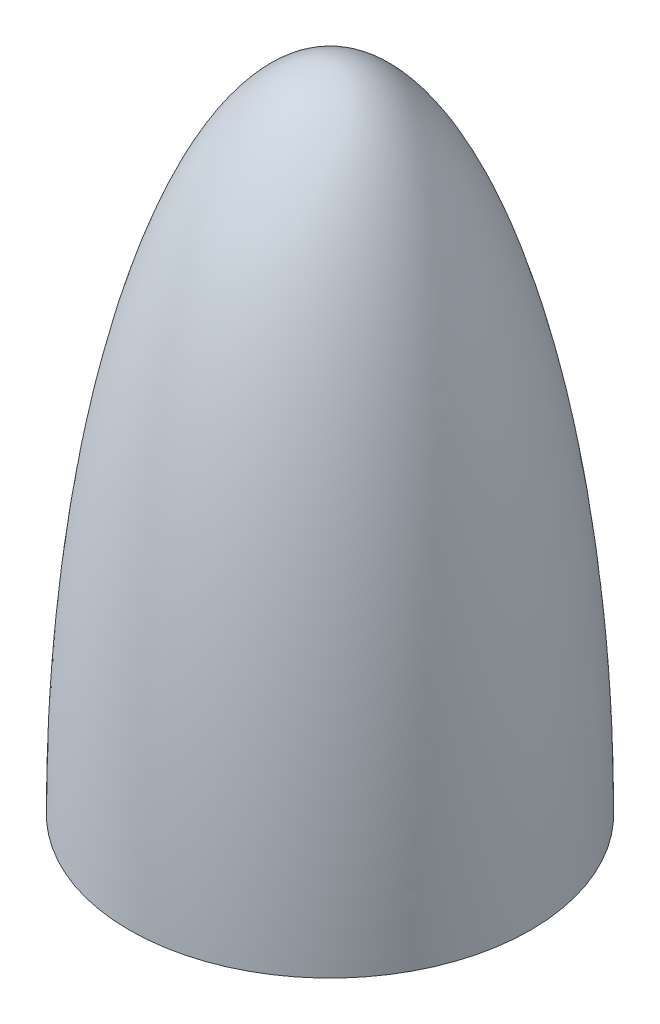
ISO-10303-21;
HEADER;
FILE_DESCRIPTION(('STEP AP214'),'2;1');
FILE_NAME('part.step','',(''),(''),'','','');
FILE_SCHEMA(('AUTOMOTIVE_DESIGN { 1 0 10303 214 1 1 1 1 }'));
ENDSEC;
DATA;
#1=APPLICATION_CONTEXT('core data for automotive mechanical design processes');
#2=APPLICATION_PROTOCOL_DEFINITION('international standard','automotive_design',2000,#1);
#3=PRODUCT_CONTEXT('',#1,'mechanical');
#4=PRODUCT('Part','Part','',(#3));
#5=PRODUCT_RELATED_PRODUCT_CATEGORY('part','',(#4));
#6=PRODUCT_DEFINITION_FORMATION('','',#4);
#7=PRODUCT_DEFINITION_CONTEXT('part definition',#1,'design');
#8=PRODUCT_DEFINITION('design','',#6,#7);
#9=PRODUCT_DEFINITION_SHAPE('','',#8);
#10=(LENGTH_UNIT() NAMED_UNIT(*) SI_UNIT(.MILLI.,.METRE.));
#11=(NAMED_UNIT(*) PLANE_ANGLE_UNIT() SI_UNIT($,.RADIAN.));
#12=(NAMED_UNIT(*) SI_UNIT($,.STERADIAN.) SOLID_ANGLE_UNIT());
#13=UNCERTAINTY_MEASURE_WITH_UNIT(LENGTH_MEASURE(1.E-05),#10,'distance_accuracy_value','');
#14=(GEOMETRIC_REPRESENTATION_CONTEXT(3) GLOBAL_UNCERTAINTY_ASSIGNED_CONTEXT((#13)) GLOBAL_UNIT_ASSIGNED_CONTEXT((#10,
#11,#12)) REPRESENTATION_CONTEXT('',''));
#15=CARTESIAN_POINT('',(0.,0.,0.));
#16=DIRECTION('',(0.,0.,1.));
#17=DIRECTION('',(1.,0.,0.));
#18=AXIS2_PLACEMENT_3D('',#15,#16,#17);
#19=CARTESIAN_POINT('',(0.,-5.39568389967826E-11,0.));
#20=DIRECTION('',(0.,1.,0.));
#21=DIRECTION('',(0.,0.,1.));
#22=AXIS2_PLACEMENT_3D('',#19,#20,#21);
#23=PLANE('',#22);
#24=CARTESIAN_POINT('',(0.,-5.39568389967826E-11,0.));
#25=DIRECTION('',(0.,-1.,0.));
#26=DIRECTION('',(0.,0.,-1.));
#27=AXIS2_PLACEMENT_3D('',#24,#25,#26);
#28=CIRCLE('',#27,78.359);
#29=CARTESIAN_POINT('',(0.,-5.39568389967826E-11,-78.359));
#30=VERTEX_POINT('',#29);
#31=EDGE_CURVE('E13',#30,#30,#28,.T.);
#32=ORIENTED_EDGE('',*,*,#31,.T.);
#33=EDGE_LOOP('',(#32));
#34=FACE_BOUND('',#33,.T.);
#35=CARTESIAN_POINT('',(0.,-5.37347943918576E-11,0.));
#36=DIRECTION('',(0.,-1.,0.));
#37=DIRECTION('',(1.,0.,0.));
#38=AXIS2_PLACEMENT_3D('',#35,#36,#37);
#39=CIRCLE('',#38,76.1746);
#40=CARTESIAN_POINT('',(76.1746,-5.3741277550358E-11,0.));
#41=VERTEX_POINT('',#40);
#42=EDGE_CURVE('E60',#41,#41,#39,.T.);
#43=ORIENTED_EDGE('',*,*,#42,.F.);
#44=EDGE_LOOP('',(#43));
#45=FACE_BOUND('',#44,.T.);
#46=ADVANCED_FACE('F48',(#34,#45),#23,.F.);
#47=CARTESIAN_POINT('',(78.359,-5.39628403691157E-11,0.));
#48=CARTESIAN_POINT('',(78.3590000000001,0.547287489017932,0.));
#49=CARTESIAN_POINT('',(78.3578456020913,1.64956361838293,0.));
#50=CARTESIAN_POINT('',(78.3526507757178,3.58634987503377,0.));
#51=CARTESIAN_POINT('',(78.3387963460281,5.98893459640201,0.));
#52=CARTESIAN_POINT('',(78.3180106719865,8.35221156854021,0.));
#53=CARTESIAN_POINT('',(78.2902889503954,10.7456008879655,0.));
#54=CARTESIAN_POINT('',(78.246958697056,13.7314118255621,0.));
#55=CARTESIAN_POINT('',(78.1810613065712,17.3117033815225,0.));
#56=CARTESIAN_POINT('',(78.0838662599076,21.4904424665611,0.));
#57=CARTESIAN_POINT('',(77.9448220852114,26.2641170070385,0.));
#58=CARTESIAN_POINT('',(77.7776831858623,31.0375576310984,0.));
#59=CARTESIAN_POINT('',(77.5822913396883,35.809557456133,0.));
#60=CARTESIAN_POINT('',(77.3584604389541,40.580511863088,0.));
#61=CARTESIAN_POINT('',(77.0428534871404,46.5422862455802,0.));
#62=CARTESIAN_POINT('',(76.679080298482,52.5014361435181,0.));
#63=CARTESIAN_POINT('',(76.2664485683162,58.4573591266273,0.));
#64=CARTESIAN_POINT('',(75.8041028056292,64.4096073986346,0.));
#65=CARTESIAN_POINT('',(75.4040152278983,69.1689496367908,0.));
#66=CARTESIAN_POINT('',(74.8656269280595,75.1147987011989,0.));
#67=CARTESIAN_POINT('',(74.1573857441952,82.2439739930406,0.));
#68=CARTESIAN_POINT('',(73.2382669176931,90.5517309552369,0.));
#69=CARTESIAN_POINT('',(72.0557405970124,100.030771810937,0.));
#70=CARTESIAN_POINT('',(70.7355289433762,109.491671533514,0.));
#71=CARTESIAN_POINT('',(69.2709291178536,118.931305028281,0.));
#72=CARTESIAN_POINT('',(67.2499969191818,130.699881306131,0.));
#73=CARTESIAN_POINT('',(64.5017329483005,144.763840426646,0.));
#74=CARTESIAN_POINT('',(61.308555538234,158.735984092174,0.));
#75=CARTESIAN_POINT('',(57.5910494958651,172.577213573719,0.));
#76=CARTESIAN_POINT('',(53.3830259383035,186.2759054785,0.));
#77=CARTESIAN_POINT('',(49.2387463120402,198.044837448537,0.));
#78=CARTESIAN_POINT('',(44.4832374304626,209.587335710912,0.));
#79=CARTESIAN_POINT('',(38.9428842352643,220.71924179016,0.));
#80=CARTESIAN_POINT('',(34.256173134855,228.693595393083,0.));
#81=CARTESIAN_POINT('',(29.8187102480322,235.095423041955,0.));
#82=CARTESIAN_POINT('',(25.6242497322616,240.182852142822,0.));
#83=CARTESIAN_POINT('',(21.9788928349695,243.926180276361,0.));
#84=CARTESIAN_POINT('',(18.5701501967582,246.859542722631,0.));
#85=CARTESIAN_POINT('',(15.4743490805522,249.076247660557,0.));
#86=CARTESIAN_POINT('',(12.5634057109101,250.78570143828,0.));
#87=CARTESIAN_POINT('',(9.77232736304579,252.083533870444,0.));
#88=CARTESIAN_POINT('',(7.06306970862825,253.028642362321,0.));
#89=CARTESIAN_POINT('',(4.27537380497182,253.68677848065,0.));
#90=CARTESIAN_POINT('',(2.18800688606534,253.939891173265,0.));
#91=CARTESIAN_POINT('',(0.767171585554611,253.999916554725,0.));
#92=CARTESIAN_POINT('',(0.,254.,0.));
#93=B_SPLINE_CURVE_WITH_KNOTS('',4,(#47,#48,#49,#50,#51,#52,#53,#54,#55,#56,#57,#58,#59,#60,#61,
#62,#63,#64,#65,#66,#67,#68,#69,#70,#71,#72,#73,#74,#75,#76,#77,#78,#79,#80,#81,#82,#83,#84,#85,
#86,#87,#88,#89,#90,#91,#92),.UNSPECIFIED.,.F.,.F.,(5,1,1,1,1,1,1,1,1,1,1,1,1,1,1,1,1,1,1,1,1,1,
1,1,1,1,1,1,1,1,1,1,1,1,1,1,1,1,1,1,1,1,5),(0.0832901678974378,0.0911196738198312,
0.0989491797422246,0.106778685664618,0.114608191587011,0.122437697509405,0.130267203431798,
0.145926215276585,0.161585227308661,0.177244239340738,0.192903251372814,0.208562263404891,
0.22422127500536,0.23988028660583,0.271198309806769,0.286857322025267,0.302516334243765,
0.318175346462263,0.333834358680761,0.365152382658847,0.396470406636932,0.427788430031848,
0.459106453426764,0.490424474288177,0.52174249514959,0.584378539310645,0.64701458132928,
0.678332609009811,0.709650636690343,0.772286631173186,0.810589211116004,0.841907031493423,
0.87260750281029,0.893486158308834,0.912628449807464,0.928287273750051,0.941044947751305,
0.952387223266141,0.962498308196118,0.972496120469674,0.981348672389275,0.98994985578346,1.),.UNSPECIFIED.);
#94=CARTESIAN_POINT('',(0.,254.,0.));
#95=DIRECTION('',(0.,-1.,0.));
#96=AXIS1_PLACEMENT('',#94,#95);
#97=SURFACE_OF_REVOLUTION('',#93,#96);
#98=CARTESIAN_POINT('',(0.,254.,0.));
#99=VERTEX_POINT('',#98);
#100=VERTEX_LOOP('',#99);
#101=FACE_BOUND('',#100,.T.);
#102=ORIENTED_EDGE('',*,*,#31,.F.);
#103=EDGE_LOOP('',(#102));
#104=FACE_BOUND('',#103,.T.);
#105=ADVANCED_FACE('F69',(#101,#104),#97,.F.);
#106=CARTESIAN_POINT('',(78.359,-5.39628403691157E-11,0.));
#107=CARTESIAN_POINT('',(78.3590000000001,0.547287489017932,0.));
#108=CARTESIAN_POINT('',(78.3578456020913,1.64956361838293,0.));
#109=CARTESIAN_POINT('',(78.3526507757178,3.58634987503377,0.));
#110=CARTESIAN_POINT('',(78.3387963460281,5.98893459640201,0.));
#111=CARTESIAN_POINT('',(78.3180106719865,8.35221156854021,0.));
#112=CARTESIAN_POINT('',(78.2902889503954,10.7456008879655,0.));
#113=CARTESIAN_POINT('',(78.246958697056,13.7314118255621,0.));
#114=CARTESIAN_POINT('',(78.1810613065712,17.3117033815225,0.));
#115=CARTESIAN_POINT('',(78.0838662599076,21.4904424665611,0.));
#116=CARTESIAN_POINT('',(77.9448220852114,26.2641170070385,0.));
#117=CARTESIAN_POINT('',(77.7776831858623,31.0375576310984,0.));
#118=CARTESIAN_POINT('',(77.5822913396883,35.809557456133,0.));
#119=CARTESIAN_POINT('',(77.3584604389541,40.580511863088,0.));
#120=CARTESIAN_POINT('',(77.0428534871404,46.5422862455802,0.));
#121=CARTESIAN_POINT('',(76.679080298482,52.5014361435181,0.));
#122=CARTESIAN_POINT('',(76.2664485683162,58.4573591266273,0.));
#123=CARTESIAN_POINT('',(75.8041028056292,64.4096073986346,0.));
#124=CARTESIAN_POINT('',(75.4040152278983,69.1689496367908,0.));
#125=CARTESIAN_POINT('',(74.8656269280595,75.1147987011989,0.));
#126=CARTESIAN_POINT('',(74.1573857441952,82.2439739930406,0.));
#127=CARTESIAN_POINT('',(73.2382669176931,90.5517309552369,0.));
#128=CARTESIAN_POINT('',(72.0557405970124,100.030771810937,0.));
#129=CARTESIAN_POINT('',(70.7355289433762,109.491671533514,0.));
#130=CARTESIAN_POINT('',(69.2709291178536,118.931305028281,0.));
#131=CARTESIAN_POINT('',(67.2499969191818,130.699881306131,0.));
#132=CARTESIAN_POINT('',(64.5017329483005,144.763840426646,0.));
#133=CARTESIAN_POINT('',(61.308555538234,158.735984092174,0.));
#134=CARTESIAN_POINT('',(57.5910494958651,172.577213573719,0.));
#135=CARTESIAN_POINT('',(53.3830259383035,186.2759054785,0.));
#136=CARTESIAN_POINT('',(49.2387463120402,198.044837448537,0.));
#137=CARTESIAN_POINT('',(44.4832374304626,209.587335710912,0.));
#138=CARTESIAN_POINT('',(38.9428842352643,220.71924179016,0.));
#139=CARTESIAN_POINT('',(34.256173134855,228.693595393083,0.));
#140=CARTESIAN_POINT('',(29.8187102480322,235.095423041955,0.));
#141=CARTESIAN_POINT('',(25.6242497322616,240.182852142822,0.));
#142=CARTESIAN_POINT('',(21.9788928349695,243.926180276361,0.));
#143=CARTESIAN_POINT('',(18.5701501967582,246.859542722631,0.));
#144=CARTESIAN_POINT('',(15.4743490805522,249.076247660557,0.));
#145=CARTESIAN_POINT('',(12.5634057109101,250.78570143828,0.));
#146=CARTESIAN_POINT('',(9.77232736304579,252.083533870444,0.));
#147=CARTESIAN_POINT('',(7.06306970862825,253.028642362321,0.));
#148=CARTESIAN_POINT('',(4.27543735562984,253.686763477226,0.));
#149=CARTESIAN_POINT('',(2.18813665185431,253.939875437727,0.));
#150=CARTESIAN_POINT('',(0.767366965814715,253.999908299879,0.));
#151=CARTESIAN_POINT('',(0.000261039127311599,253.999999970206,0.));
#152=B_SPLINE_CURVE_WITH_KNOTS('',4,(#106,#107,#108,#109,#110,#111,#112,#113,#114,#115,#116,
#117,#118,#119,#120,#121,#122,#123,#124,#125,#126,#127,#128,#129,#130,#131,#132,#133,#134,#135,
#136,#137,#138,#139,#140,#141,#142,#143,#144,#145,#146,#147,#148,#149,#150,#151),.UNSPECIFIED.,
.F.,.F.,(5,1,1,1,1,1,1,1,1,1,1,1,1,1,1,1,1,1,1,1,1,1,1,1,1,1,1,1,1,1,1,1,1,1,1,1,1,1,1,1,1,1,5),
(0.0832901678974378,0.0911196738198312,0.0989491797422246,0.106778685664618,0.114608191587011,
0.122437697509405,0.130267203431798,0.145926215276585,0.161585227308661,0.177244239340738,
0.192903251372814,0.208562263404891,0.22422127500536,0.23988028660583,0.271198309806769,
0.286857322025267,0.302516334243765,0.318175346462263,0.333834358680761,0.365152382658847,
0.396470406636932,0.427788430031848,0.459106453426764,0.490424474288177,0.52174249514959,
0.584378539310645,0.64701458132928,0.678332609009811,0.709650636690343,0.772286631173186,
0.810589211116004,0.841907031493423,0.87260750281029,0.893486158308834,0.912628449807464,
0.928287273750051,0.941044947751305,0.952387223266141,0.962498308196118,0.972496120469674,
0.981348672389275,0.98994985578346,0.999999145079925),.UNSPECIFIED.);
#153=CARTESIAN_POINT('',(0.,254.,0.));
#154=DIRECTION('',(0.,-1.,0.));
#155=AXIS1_PLACEMENT('',#153,#154);
#156=SURFACE_OF_REVOLUTION('',#152,#155);
#157=OFFSET_SURFACE('',#156,2.1844,.F.);
#158=CARTESIAN_POINT('',(5.65844902061948E-13,251.815599985803,0.));
#159=VERTEX_POINT('',#158);
#160=VERTEX_LOOP('',#159);
#161=FACE_BOUND('',#160,.T.);
#162=ORIENTED_EDGE('',*,*,#42,.T.);
#163=EDGE_LOOP('',(#162));
#164=FACE_BOUND('',#163,.T.);
#165=ADVANCED_FACE('F66',(#161,#164),#157,.T.);
#166=CLOSED_SHELL('',(#46,#105,#165));
#167=MANIFOLD_SOLID_BREP('B2',#166);
#168=ADVANCED_BREP_SHAPE_REPRESENTATION('',(#18,#167),#14);
#169=SHAPE_DEFINITION_REPRESENTATION(#9,#168);
ENDSEC;
END-ISO-10303-21;
